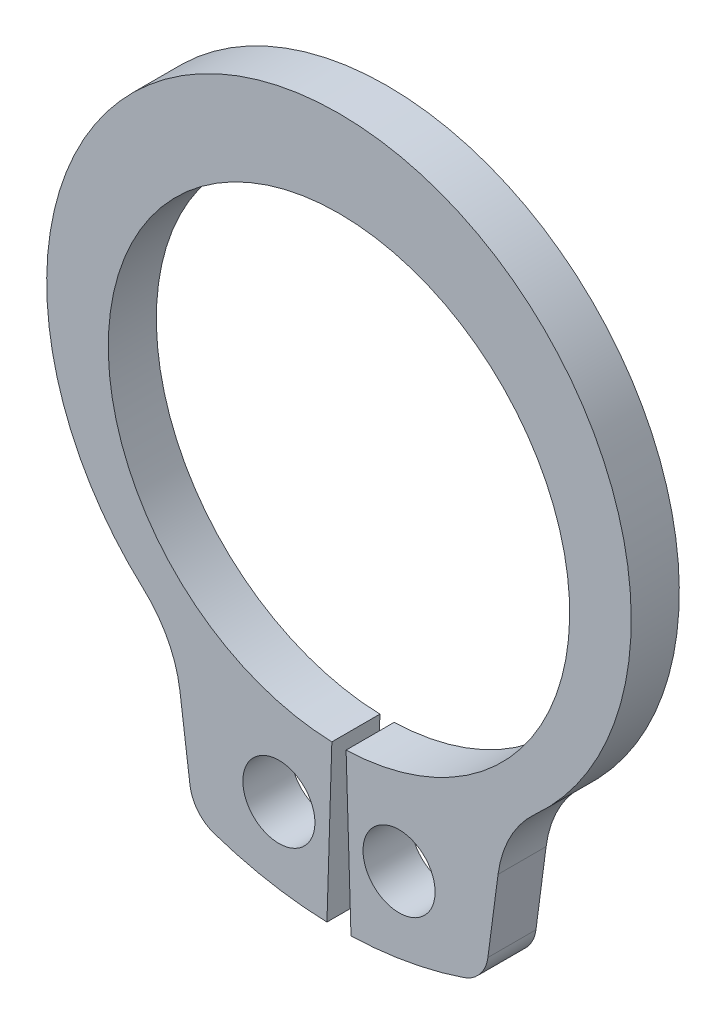
ISO-10303-21;
HEADER;
FILE_DESCRIPTION(('STEP AP214'),'2;1');
FILE_NAME('part.step','',(''),(''),'','','');
FILE_SCHEMA(('AUTOMOTIVE_DESIGN { 1 0 10303 214 1 1 1 1 }'));
ENDSEC;
DATA;
#1=APPLICATION_CONTEXT('core data for automotive mechanical design processes');
#2=APPLICATION_PROTOCOL_DEFINITION('international standard','automotive_design',2000,#1);
#3=PRODUCT_CONTEXT('',#1,'mechanical');
#4=PRODUCT('Part','Part','',(#3));
#5=PRODUCT_RELATED_PRODUCT_CATEGORY('part','',(#4));
#6=PRODUCT_DEFINITION_FORMATION('','',#4);
#7=PRODUCT_DEFINITION_CONTEXT('part definition',#1,'design');
#8=PRODUCT_DEFINITION('design','',#6,#7);
#9=PRODUCT_DEFINITION_SHAPE('','',#8);
#10=(LENGTH_UNIT() NAMED_UNIT(*) SI_UNIT(.MILLI.,.METRE.));
#11=(NAMED_UNIT(*) PLANE_ANGLE_UNIT() SI_UNIT($,.RADIAN.));
#12=(NAMED_UNIT(*) SI_UNIT($,.STERADIAN.) SOLID_ANGLE_UNIT());
#13=UNCERTAINTY_MEASURE_WITH_UNIT(LENGTH_MEASURE(1.E-05),#10,'distance_accuracy_value','');
#14=(GEOMETRIC_REPRESENTATION_CONTEXT(3) GLOBAL_UNCERTAINTY_ASSIGNED_CONTEXT((#13)) GLOBAL_UNIT_ASSIGNED_CONTEXT((#10,
#11,#12)) REPRESENTATION_CONTEXT('',''));
#15=CARTESIAN_POINT('',(0.,0.,0.));
#16=DIRECTION('',(0.,0.,1.));
#17=DIRECTION('',(1.,0.,0.));
#18=AXIS2_PLACEMENT_3D('',#15,#16,#17);
#19=CARTESIAN_POINT('',(0.,0.,-1.));
#20=DIRECTION('',(0.,0.,1.));
#21=DIRECTION('',(1.,0.,0.));
#22=AXIS2_PLACEMENT_3D('',#19,#20,#21);
#23=CYLINDRICAL_SURFACE('',#22,4.8);
#24=CARTESIAN_POINT('',(0.,0.,0.));
#25=DIRECTION('',(0.,0.,-1.));
#26=DIRECTION('',(1.,0.,0.));
#27=AXIS2_PLACEMENT_3D('',#24,#25,#26);
#28=CIRCLE('',#27,4.8);
#29=CARTESIAN_POINT('',(-0.148148148148148,-4.79771321841982,0.));
#30=VERTEX_POINT('',#29);
#31=CARTESIAN_POINT('',(0.148148148148148,-4.79771321841982,0.));
#32=VERTEX_POINT('',#31);
#33=EDGE_CURVE('E160',#30,#32,#28,.T.);
#34=ORIENTED_EDGE('',*,*,#33,.F.);
#35=DIRECTION('',(0.,0.,1.));
#36=VECTOR('',#35,1.);
#37=CARTESIAN_POINT('',(-0.148148148148148,-4.79771321841982,-1.));
#38=LINE('',#37,#36);
#39=CARTESIAN_POINT('',(-0.148148148148148,-4.79771321841982,-1.));
#40=VERTEX_POINT('',#39);
#41=EDGE_CURVE('E11',#40,#30,#38,.T.);
#42=ORIENTED_EDGE('',*,*,#41,.F.);
#43=CARTESIAN_POINT('',(0.,0.,-1.));
#44=DIRECTION('',(0.,0.,-1.));
#45=DIRECTION('',(1.,0.,0.));
#46=AXIS2_PLACEMENT_3D('',#43,#44,#45);
#47=CIRCLE('',#46,4.8);
#48=CARTESIAN_POINT('',(0.148148148148148,-4.79771321841982,-1.));
#49=VERTEX_POINT('',#48);
#50=EDGE_CURVE('E193',#40,#49,#47,.T.);
#51=ORIENTED_EDGE('',*,*,#50,.T.);
#52=DIRECTION('',(0.,0.,1.));
#53=VECTOR('',#52,1.);
#54=CARTESIAN_POINT('',(0.148148148148148,-4.79771321841982,-1.));
#55=LINE('',#54,#53);
#56=EDGE_CURVE('E42',#49,#32,#55,.T.);
#57=ORIENTED_EDGE('',*,*,#56,.T.);
#58=EDGE_LOOP('',(#34,#42,#51,#57));
#59=FACE_BOUND('',#58,.T.);
#60=ADVANCED_FACE('F39',(#59),#23,.F.);
#61=CARTESIAN_POINT('',(-0.148148148148148,-4.79771321841982,-1.));
#62=DIRECTION('',(0.999523587170796,-0.0308641975308642,0.));
#63=DIRECTION('',(0.0308641975308642,0.999523587170796,0.));
#64=AXIS2_PLACEMENT_3D('',#61,#62,#63);
#65=PLANE('',#64);
#66=DIRECTION('',(0.0308641975308642,0.999523587170796,0.));
#67=VECTOR('',#66,1.);
#68=CARTESIAN_POINT('',(-0.148148148148148,-4.79771321841982,0.));
#69=LINE('',#68,#67);
#70=CARTESIAN_POINT('',(-0.25,-8.09614105608345,0.));
#71=VERTEX_POINT('',#70);
#72=EDGE_CURVE('E191',#71,#30,#69,.T.);
#73=ORIENTED_EDGE('',*,*,#72,.F.);
#74=DIRECTION('',(0.,0.,1.));
#75=VECTOR('',#74,1.);
#76=CARTESIAN_POINT('',(-0.25,-8.09614105608345,-1.));
#77=LINE('',#76,#75);
#78=CARTESIAN_POINT('',(-0.25,-8.09614105608345,-1.));
#79=VERTEX_POINT('',#78);
#80=EDGE_CURVE('E48',#79,#71,#77,.T.);
#81=ORIENTED_EDGE('',*,*,#80,.F.);
#82=DIRECTION('',(0.0308641975308642,0.999523587170796,0.));
#83=VECTOR('',#82,1.);
#84=CARTESIAN_POINT('',(-0.148148148148148,-4.79771321841982,-1.));
#85=LINE('',#84,#83);
#86=EDGE_CURVE('E150',#79,#40,#85,.T.);
#87=ORIENTED_EDGE('',*,*,#86,.T.);
#88=ORIENTED_EDGE('',*,*,#41,.T.);
#89=EDGE_LOOP('',(#73,#81,#87,#88));
#90=FACE_BOUND('',#89,.T.);
#91=ADVANCED_FACE('F213',(#90),#65,.T.);
#92=CARTESIAN_POINT('',(0.,0.,-1.));
#93=DIRECTION('',(0.,0.,1.));
#94=DIRECTION('',(1.,0.,0.));
#95=AXIS2_PLACEMENT_3D('',#92,#93,#94);
#96=CYLINDRICAL_SURFACE('',#95,8.1);
#97=CARTESIAN_POINT('',(0.,0.,0.));
#98=DIRECTION('',(0.,0.,1.));
#99=DIRECTION('',(1.,0.,0.));
#100=AXIS2_PLACEMENT_3D('',#97,#98,#99);
#101=CIRCLE('',#100,8.1);
#102=CARTESIAN_POINT('',(-2.59511535496144,-7.67302914724317,0.));
#103=VERTEX_POINT('',#102);
#104=EDGE_CURVE('E137',#103,#71,#101,.T.);
#105=ORIENTED_EDGE('',*,*,#104,.F.);
#106=DIRECTION('',(0.,0.,1.));
#107=VECTOR('',#106,1.);
#108=CARTESIAN_POINT('',(-2.59511535496144,-7.67302914724317,-1.));
#109=LINE('',#108,#107);
#110=CARTESIAN_POINT('',(-2.59511535496144,-7.67302914724317,-1.));
#111=VERTEX_POINT('',#110);
#112=EDGE_CURVE('E132',#111,#103,#109,.T.);
#113=ORIENTED_EDGE('',*,*,#112,.F.);
#114=CARTESIAN_POINT('',(0.,0.,-1.));
#115=DIRECTION('',(0.,0.,1.));
#116=DIRECTION('',(1.,0.,0.));
#117=AXIS2_PLACEMENT_3D('',#114,#115,#116);
#118=CIRCLE('',#117,8.1);
#119=EDGE_CURVE('E135',#111,#79,#118,.T.);
#120=ORIENTED_EDGE('',*,*,#119,.T.);
#121=ORIENTED_EDGE('',*,*,#80,.T.);
#122=EDGE_LOOP('',(#105,#113,#120,#121));
#123=FACE_BOUND('',#122,.T.);
#124=ADVANCED_FACE('F134',(#123),#96,.T.);
#125=CARTESIAN_POINT('',(-2.35482689616871,-6.9625634854614,-1.));
#126=DIRECTION('',(0.,0.,1.));
#127=DIRECTION('',(1.,0.,0.));
#128=AXIS2_PLACEMENT_3D('',#125,#126,#127);
#129=CYLINDRICAL_SURFACE('',#128,0.75);
#130=CARTESIAN_POINT('',(-2.35482689616871,-6.9625634854614,0.));
#131=DIRECTION('',(0.,0.,1.));
#132=DIRECTION('',(1.,0.,0.));
#133=AXIS2_PLACEMENT_3D('',#130,#131,#132);
#134=CIRCLE('',#133,0.75);
#135=CARTESIAN_POINT('',(-3.09841054219907,-7.06045812962644,0.));
#136=VERTEX_POINT('',#135);
#137=EDGE_CURVE('E188',#136,#103,#134,.T.);
#138=ORIENTED_EDGE('',*,*,#137,.F.);
#139=DIRECTION('',(0.,0.,1.));
#140=VECTOR('',#139,1.);
#141=CARTESIAN_POINT('',(-3.09841054219907,-7.06045812962644,-1.));
#142=LINE('',#141,#140);
#143=CARTESIAN_POINT('',(-3.09841054219907,-7.06045812962644,-1.));
#144=VERTEX_POINT('',#143);
#145=EDGE_CURVE('E142',#144,#136,#142,.T.);
#146=ORIENTED_EDGE('',*,*,#145,.F.);
#147=CARTESIAN_POINT('',(-2.35482689616871,-6.9625634854614,-1.));
#148=DIRECTION('',(0.,0.,1.));
#149=DIRECTION('',(1.,0.,0.));
#150=AXIS2_PLACEMENT_3D('',#147,#148,#149);
#151=CIRCLE('',#150,0.75);
#152=EDGE_CURVE('E148',#144,#111,#151,.T.);
#153=ORIENTED_EDGE('',*,*,#152,.T.);
#154=ORIENTED_EDGE('',*,*,#112,.T.);
#155=EDGE_LOOP('',(#138,#146,#153,#154));
#156=FACE_BOUND('',#155,.T.);
#157=ADVANCED_FACE('F152',(#156),#129,.T.);
#158=CARTESIAN_POINT('',(-3.30965181475856,-5.45592136480539,-1.));
#159=DIRECTION('',(-0.99144486137381,-0.130526192220052,0.));
#160=DIRECTION('',(0.130526192220052,-0.99144486137381,0.));
#161=AXIS2_PLACEMENT_3D('',#158,#159,#160);
#162=PLANE('',#161);
#163=DIRECTION('',(0.130526192220052,-0.99144486137381,0.));
#164=VECTOR('',#163,1.);
#165=CARTESIAN_POINT('',(-3.30965181475856,-5.45592136480539,0.));
#166=LINE('',#165,#164);
#167=CARTESIAN_POINT('',(-3.30965181475856,-5.45592136480539,0.));
#168=VERTEX_POINT('',#167);
#169=EDGE_CURVE('E185',#168,#136,#166,.T.);
#170=ORIENTED_EDGE('',*,*,#169,.F.);
#171=DIRECTION('',(0.,0.,1.));
#172=VECTOR('',#171,1.);
#173=CARTESIAN_POINT('',(-3.30965181475856,-5.45592136480539,-1.));
#174=LINE('',#173,#172);
#175=CARTESIAN_POINT('',(-3.30965181475856,-5.45592136480539,-1.));
#176=VERTEX_POINT('',#175);
#177=EDGE_CURVE('E197',#176,#168,#174,.T.);
#178=ORIENTED_EDGE('',*,*,#177,.F.);
#179=DIRECTION('',(0.130526192220052,-0.99144486137381,0.));
#180=VECTOR('',#179,1.);
#181=CARTESIAN_POINT('',(-3.30965181475856,-5.45592136480539,-1.));
#182=LINE('',#181,#180);
#183=EDGE_CURVE('E153',#176,#144,#182,.T.);
#184=ORIENTED_EDGE('',*,*,#183,.T.);
#185=ORIENTED_EDGE('',*,*,#145,.T.);
#186=EDGE_LOOP('',(#170,#178,#184,#185));
#187=FACE_BOUND('',#186,.T.);
#188=ADVANCED_FACE('F226',(#187),#162,.T.);
#189=CARTESIAN_POINT('',(-5.68605087745157,-5.76878023667328,-1.));
#190=DIRECTION('',(0.,0.,1.));
#191=DIRECTION('',(1.,0.,0.));
#192=AXIS2_PLACEMENT_3D('',#189,#190,#191);
#193=CYLINDRICAL_SURFACE('',#192,2.3969049165277);
#194=CARTESIAN_POINT('',(-5.68605087745157,-5.76878023667328,0.));
#195=DIRECTION('',(0.,0.,-1.));
#196=DIRECTION('',(1.,0.,0.));
#197=AXIS2_PLACEMENT_3D('',#194,#195,#196);
#198=CIRCLE('',#197,2.3969049165277);
#199=CARTESIAN_POINT('',(-4.07842108653022,-3.99095020142895,0.));
#200=VERTEX_POINT('',#199);
#201=EDGE_CURVE('E182',#200,#168,#198,.T.);
#202=ORIENTED_EDGE('',*,*,#201,.F.);
#203=DIRECTION('',(0.,0.,1.));
#204=VECTOR('',#203,1.);
#205=CARTESIAN_POINT('',(-4.07842108653022,-3.99095020142895,-1.));
#206=LINE('',#205,#204);
#207=CARTESIAN_POINT('',(-4.07842108653022,-3.99095020142895,-1.));
#208=VERTEX_POINT('',#207);
#209=EDGE_CURVE('E199',#208,#200,#206,.T.);
#210=ORIENTED_EDGE('',*,*,#209,.F.);
#211=CARTESIAN_POINT('',(-5.68605087745157,-5.76878023667328,-1.));
#212=DIRECTION('',(0.,0.,-1.));
#213=DIRECTION('',(1.,0.,0.));
#214=AXIS2_PLACEMENT_3D('',#211,#212,#213);
#215=CIRCLE('',#214,2.3969049165277);
#216=EDGE_CURVE('E155',#208,#176,#215,.T.);
#217=ORIENTED_EDGE('',*,*,#216,.T.);
#218=ORIENTED_EDGE('',*,*,#177,.T.);
#219=EDGE_LOOP('',(#202,#210,#217,#218));
#220=FACE_BOUND('',#219,.T.);
#221=ADVANCED_FACE('F229',(#220),#193,.F.);
#222=CARTESIAN_POINT('',(0.,0.519254539086392,-1.));
#223=DIRECTION('',(0.,0.,1.));
#224=DIRECTION('',(1.,0.,0.));
#225=AXIS2_PLACEMENT_3D('',#222,#223,#224);
#226=CYLINDRICAL_SURFACE('',#225,6.08074546091361);
#227=CARTESIAN_POINT('',(0.,0.519254539086392,0.));
#228=DIRECTION('',(0.,0.,1.));
#229=DIRECTION('',(1.,0.,0.));
#230=AXIS2_PLACEMENT_3D('',#227,#228,#229);
#231=CIRCLE('',#230,6.08074546091361);
#232=CARTESIAN_POINT('',(4.07842108653021,-3.99095020142896,0.));
#233=VERTEX_POINT('',#232);
#234=EDGE_CURVE('E179',#233,#200,#231,.T.);
#235=ORIENTED_EDGE('',*,*,#234,.F.);
#236=DIRECTION('',(0.,0.,1.));
#237=VECTOR('',#236,1.);
#238=CARTESIAN_POINT('',(4.07842108653021,-3.99095020142896,-1.));
#239=LINE('',#238,#237);
#240=CARTESIAN_POINT('',(4.07842108653021,-3.99095020142896,-1.));
#241=VERTEX_POINT('',#240);
#242=EDGE_CURVE('E201',#241,#233,#239,.T.);
#243=ORIENTED_EDGE('',*,*,#242,.F.);
#244=CARTESIAN_POINT('',(0.,0.519254539086392,-1.));
#245=DIRECTION('',(0.,0.,1.));
#246=DIRECTION('',(1.,0.,0.));
#247=AXIS2_PLACEMENT_3D('',#244,#245,#246);
#248=CIRCLE('',#247,6.08074546091361);
#249=EDGE_CURVE('E303',#241,#208,#248,.T.);
#250=ORIENTED_EDGE('',*,*,#249,.T.);
#251=ORIENTED_EDGE('',*,*,#209,.T.);
#252=EDGE_LOOP('',(#235,#243,#250,#251));
#253=FACE_BOUND('',#252,.T.);
#254=ADVANCED_FACE('F233',(#253),#226,.T.);
#255=CARTESIAN_POINT('',(5.68605087745157,-5.76878023667328,-1.));
#256=DIRECTION('',(0.,0.,1.));
#257=DIRECTION('',(1.,0.,0.));
#258=AXIS2_PLACEMENT_3D('',#255,#256,#257);
#259=CYLINDRICAL_SURFACE('',#258,2.3969049165277);
#260=CARTESIAN_POINT('',(5.68605087745157,-5.76878023667328,0.));
#261=DIRECTION('',(0.,0.,-1.));
#262=DIRECTION('',(1.,0.,0.));
#263=AXIS2_PLACEMENT_3D('',#260,#261,#262);
#264=CIRCLE('',#263,2.3969049165277);
#265=CARTESIAN_POINT('',(3.30965181475856,-5.45592136480539,0.));
#266=VERTEX_POINT('',#265);
#267=EDGE_CURVE('E176',#266,#233,#264,.T.);
#268=ORIENTED_EDGE('',*,*,#267,.F.);
#269=DIRECTION('',(0.,0.,1.));
#270=VECTOR('',#269,1.);
#271=CARTESIAN_POINT('',(3.30965181475856,-5.45592136480539,-1.));
#272=LINE('',#271,#270);
#273=CARTESIAN_POINT('',(3.30965181475856,-5.45592136480539,-1.));
#274=VERTEX_POINT('',#273);
#275=EDGE_CURVE('E203',#274,#266,#272,.T.);
#276=ORIENTED_EDGE('',*,*,#275,.F.);
#277=CARTESIAN_POINT('',(5.68605087745157,-5.76878023667328,-1.));
#278=DIRECTION('',(0.,0.,-1.));
#279=DIRECTION('',(1.,0.,0.));
#280=AXIS2_PLACEMENT_3D('',#277,#278,#279);
#281=CIRCLE('',#280,2.3969049165277);
#282=EDGE_CURVE('E300',#274,#241,#281,.T.);
#283=ORIENTED_EDGE('',*,*,#282,.T.);
#284=ORIENTED_EDGE('',*,*,#242,.T.);
#285=EDGE_LOOP('',(#268,#276,#283,#284));
#286=FACE_BOUND('',#285,.T.);
#287=ADVANCED_FACE('F237',(#286),#259,.F.);
#288=CARTESIAN_POINT('',(3.30965181475856,-5.45592136480539,-1.));
#289=DIRECTION('',(0.99144486137381,-0.130526192220052,0.));
#290=DIRECTION('',(0.130526192220052,0.99144486137381,0.));
#291=AXIS2_PLACEMENT_3D('',#288,#289,#290);
#292=PLANE('',#291);
#293=DIRECTION('',(0.130526192220052,0.99144486137381,0.));
#294=VECTOR('',#293,1.);
#295=CARTESIAN_POINT('',(3.30965181475856,-5.45592136480539,0.));
#296=LINE('',#295,#294);
#297=CARTESIAN_POINT('',(3.09841054219907,-7.06045812962644,0.));
#298=VERTEX_POINT('',#297);
#299=EDGE_CURVE('E173',#298,#266,#296,.T.);
#300=ORIENTED_EDGE('',*,*,#299,.F.);
#301=DIRECTION('',(0.,0.,1.));
#302=VECTOR('',#301,1.);
#303=CARTESIAN_POINT('',(3.09841054219907,-7.06045812962644,-1.));
#304=LINE('',#303,#302);
#305=CARTESIAN_POINT('',(3.09841054219907,-7.06045812962644,-1.));
#306=VERTEX_POINT('',#305);
#307=EDGE_CURVE('E205',#306,#298,#304,.T.);
#308=ORIENTED_EDGE('',*,*,#307,.F.);
#309=DIRECTION('',(0.130526192220052,0.99144486137381,0.));
#310=VECTOR('',#309,1.);
#311=CARTESIAN_POINT('',(3.30965181475856,-5.45592136480539,-1.));
#312=LINE('',#311,#310);
#313=EDGE_CURVE('E297',#306,#274,#312,.T.);
#314=ORIENTED_EDGE('',*,*,#313,.T.);
#315=ORIENTED_EDGE('',*,*,#275,.T.);
#316=EDGE_LOOP('',(#300,#308,#314,#315));
#317=FACE_BOUND('',#316,.T.);
#318=ADVANCED_FACE('F241',(#317),#292,.T.);
#319=CARTESIAN_POINT('',(2.35482689616871,-6.9625634854614,-1.));
#320=DIRECTION('',(0.,0.,1.));
#321=DIRECTION('',(1.,0.,0.));
#322=AXIS2_PLACEMENT_3D('',#319,#320,#321);
#323=CYLINDRICAL_SURFACE('',#322,0.75);
#324=CARTESIAN_POINT('',(2.35482689616871,-6.9625634854614,0.));
#325=DIRECTION('',(0.,0.,1.));
#326=DIRECTION('',(-1.,0.,0.));
#327=AXIS2_PLACEMENT_3D('',#324,#325,#326);
#328=CIRCLE('',#327,0.75);
#329=CARTESIAN_POINT('',(2.59511535496144,-7.67302914724318,0.));
#330=VERTEX_POINT('',#329);
#331=EDGE_CURVE('E170',#330,#298,#328,.T.);
#332=ORIENTED_EDGE('',*,*,#331,.F.);
#333=DIRECTION('',(0.,0.,1.));
#334=VECTOR('',#333,1.);
#335=CARTESIAN_POINT('',(2.59511535496144,-7.67302914724318,-1.));
#336=LINE('',#335,#334);
#337=CARTESIAN_POINT('',(2.59511535496144,-7.67302914724318,-1.));
#338=VERTEX_POINT('',#337);
#339=EDGE_CURVE('E207',#338,#330,#336,.T.);
#340=ORIENTED_EDGE('',*,*,#339,.F.);
#341=CARTESIAN_POINT('',(2.35482689616871,-6.9625634854614,-1.));
#342=DIRECTION('',(0.,0.,1.));
#343=DIRECTION('',(-1.,0.,0.));
#344=AXIS2_PLACEMENT_3D('',#341,#342,#343);
#345=CIRCLE('',#344,0.75);
#346=EDGE_CURVE('E294',#338,#306,#345,.T.);
#347=ORIENTED_EDGE('',*,*,#346,.T.);
#348=ORIENTED_EDGE('',*,*,#307,.T.);
#349=EDGE_LOOP('',(#332,#340,#347,#348));
#350=FACE_BOUND('',#349,.T.);
#351=ADVANCED_FACE('F245',(#350),#323,.T.);
#352=CARTESIAN_POINT('',(0.,0.,-1.));
#353=DIRECTION('',(0.,0.,1.));
#354=DIRECTION('',(1.,0.,0.));
#355=AXIS2_PLACEMENT_3D('',#352,#353,#354);
#356=CYLINDRICAL_SURFACE('',#355,8.1);
#357=CARTESIAN_POINT('',(0.,0.,0.));
#358=DIRECTION('',(0.,0.,1.));
#359=DIRECTION('',(1.,0.,0.));
#360=AXIS2_PLACEMENT_3D('',#357,#358,#359);
#361=CIRCLE('',#360,8.1);
#362=CARTESIAN_POINT('',(0.249999999999997,-8.09614105608345,0.));
#363=VERTEX_POINT('',#362);
#364=EDGE_CURVE('E167',#363,#330,#361,.T.);
#365=ORIENTED_EDGE('',*,*,#364,.F.);
#366=DIRECTION('',(0.,0.,1.));
#367=VECTOR('',#366,1.);
#368=CARTESIAN_POINT('',(0.249999999999997,-8.09614105608345,-1.));
#369=LINE('',#368,#367);
#370=CARTESIAN_POINT('',(0.249999999999997,-8.09614105608345,-1.));
#371=VERTEX_POINT('',#370);
#372=EDGE_CURVE('E208',#371,#363,#369,.T.);
#373=ORIENTED_EDGE('',*,*,#372,.F.);
#374=CARTESIAN_POINT('',(0.,0.,-1.));
#375=DIRECTION('',(0.,0.,1.));
#376=DIRECTION('',(1.,0.,0.));
#377=AXIS2_PLACEMENT_3D('',#374,#375,#376);
#378=CIRCLE('',#377,8.1);
#379=EDGE_CURVE('E291',#371,#338,#378,.T.);
#380=ORIENTED_EDGE('',*,*,#379,.T.);
#381=ORIENTED_EDGE('',*,*,#339,.T.);
#382=EDGE_LOOP('',(#365,#373,#380,#381));
#383=FACE_BOUND('',#382,.T.);
#384=ADVANCED_FACE('F249',(#383),#356,.T.);
#385=CARTESIAN_POINT('',(0.148148148148148,-4.79771321841982,-1.));
#386=DIRECTION('',(-0.999523587170796,-0.0308641975308642,0.));
#387=DIRECTION('',(0.0308641975308642,-0.999523587170796,0.));
#388=AXIS2_PLACEMENT_3D('',#385,#386,#387);
#389=PLANE('',#388);
#390=DIRECTION('',(0.0308641975308642,-0.999523587170796,0.));
#391=VECTOR('',#390,1.);
#392=CARTESIAN_POINT('',(0.148148148148148,-4.79771321841982,0.));
#393=LINE('',#392,#391);
#394=EDGE_CURVE('E163',#32,#363,#393,.T.);
#395=ORIENTED_EDGE('',*,*,#394,.F.);
#396=ORIENTED_EDGE('',*,*,#56,.F.);
#397=DIRECTION('',(0.0308641975308642,-0.999523587170796,0.));
#398=VECTOR('',#397,1.);
#399=CARTESIAN_POINT('',(0.148148148148148,-4.79771321841982,-1.));
#400=LINE('',#399,#398);
#401=EDGE_CURVE('E289',#49,#371,#400,.T.);
#402=ORIENTED_EDGE('',*,*,#401,.T.);
#403=ORIENTED_EDGE('',*,*,#372,.T.);
#404=EDGE_LOOP('',(#395,#396,#402,#403));
#405=FACE_BOUND('',#404,.T.);
#406=ADVANCED_FACE('F210',(#405),#389,.T.);
#407=CARTESIAN_POINT('',(0.,0.,-1.));
#408=DIRECTION('',(0.,0.,1.));
#409=DIRECTION('',(1.,0.,0.));
#410=AXIS2_PLACEMENT_3D('',#407,#408,#409);
#411=PLANE('',#410);
#412=CARTESIAN_POINT('',(-1.25,-6.4296189622714,-1.));
#413=DIRECTION('',(0.,0.,1.));
#414=DIRECTION('',(1.,0.,0.));
#415=AXIS2_PLACEMENT_3D('',#412,#413,#414);
#416=CIRCLE('',#415,0.75);
#417=CARTESIAN_POINT('',(-0.5,-6.4296189622714,-1.));
#418=VERTEX_POINT('',#417);
#419=EDGE_CURVE('E276',#418,#418,#416,.T.);
#420=ORIENTED_EDGE('',*,*,#419,.T.);
#421=EDGE_LOOP('',(#420));
#422=FACE_BOUND('',#421,.T.);
#423=CARTESIAN_POINT('',(1.25,-6.4296189622714,-1.));
#424=DIRECTION('',(0.,0.,1.));
#425=DIRECTION('',(1.,0.,0.));
#426=AXIS2_PLACEMENT_3D('',#423,#424,#425);
#427=CIRCLE('',#426,0.75);
#428=CARTESIAN_POINT('',(2.,-6.4296189622714,-1.));
#429=VERTEX_POINT('',#428);
#430=EDGE_CURVE('E164',#429,#429,#427,.T.);
#431=ORIENTED_EDGE('',*,*,#430,.T.);
#432=EDGE_LOOP('',(#431));
#433=FACE_BOUND('',#432,.T.);
#434=ORIENTED_EDGE('',*,*,#50,.F.);
#435=ORIENTED_EDGE('',*,*,#86,.F.);
#436=ORIENTED_EDGE('',*,*,#119,.F.);
#437=ORIENTED_EDGE('',*,*,#152,.F.);
#438=ORIENTED_EDGE('',*,*,#183,.F.);
#439=ORIENTED_EDGE('',*,*,#216,.F.);
#440=ORIENTED_EDGE('',*,*,#249,.F.);
#441=ORIENTED_EDGE('',*,*,#282,.F.);
#442=ORIENTED_EDGE('',*,*,#313,.F.);
#443=ORIENTED_EDGE('',*,*,#346,.F.);
#444=ORIENTED_EDGE('',*,*,#379,.F.);
#445=ORIENTED_EDGE('',*,*,#401,.F.);
#446=EDGE_LOOP('',(#434,#435,#436,#437,#438,#439,#440,#441,#442,#443,#444,#445));
#447=FACE_BOUND('',#446,.T.);
#448=ADVANCED_FACE('F146',(#422,#433,#447),#411,.F.);
#449=CARTESIAN_POINT('',(0.,0.,0.));
#450=DIRECTION('',(0.,0.,1.));
#451=DIRECTION('',(1.,0.,0.));
#452=AXIS2_PLACEMENT_3D('',#449,#450,#451);
#453=PLANE('',#452);
#454=CARTESIAN_POINT('',(-1.25,-6.4296189622714,0.));
#455=DIRECTION('',(0.,0.,1.));
#456=DIRECTION('',(1.,0.,0.));
#457=AXIS2_PLACEMENT_3D('',#454,#455,#456);
#458=CIRCLE('',#457,0.75);
#459=CARTESIAN_POINT('',(-0.5,-6.4296189622714,0.));
#460=VERTEX_POINT('',#459);
#461=EDGE_CURVE('E279',#460,#460,#458,.T.);
#462=ORIENTED_EDGE('',*,*,#461,.F.);
#463=EDGE_LOOP('',(#462));
#464=FACE_BOUND('',#463,.T.);
#465=CARTESIAN_POINT('',(1.25,-6.4296189622714,0.));
#466=DIRECTION('',(0.,0.,1.));
#467=DIRECTION('',(1.,0.,0.));
#468=AXIS2_PLACEMENT_3D('',#465,#466,#467);
#469=CIRCLE('',#468,0.75);
#470=CARTESIAN_POINT('',(2.,-6.4296189622714,0.));
#471=VERTEX_POINT('',#470);
#472=EDGE_CURVE('E281',#471,#471,#469,.T.);
#473=ORIENTED_EDGE('',*,*,#472,.F.);
#474=EDGE_LOOP('',(#473));
#475=FACE_BOUND('',#474,.T.);
#476=ORIENTED_EDGE('',*,*,#33,.T.);
#477=ORIENTED_EDGE('',*,*,#394,.T.);
#478=ORIENTED_EDGE('',*,*,#364,.T.);
#479=ORIENTED_EDGE('',*,*,#331,.T.);
#480=ORIENTED_EDGE('',*,*,#299,.T.);
#481=ORIENTED_EDGE('',*,*,#267,.T.);
#482=ORIENTED_EDGE('',*,*,#234,.T.);
#483=ORIENTED_EDGE('',*,*,#201,.T.);
#484=ORIENTED_EDGE('',*,*,#169,.T.);
#485=ORIENTED_EDGE('',*,*,#137,.T.);
#486=ORIENTED_EDGE('',*,*,#104,.T.);
#487=ORIENTED_EDGE('',*,*,#72,.T.);
#488=EDGE_LOOP('',(#476,#477,#478,#479,#480,#481,#482,#483,#484,#485,#486,#487));
#489=FACE_BOUND('',#488,.T.);
#490=ADVANCED_FACE('F212',(#464,#475,#489),#453,.T.);
#491=CARTESIAN_POINT('',(1.25,-6.4296189622714,-1.));
#492=DIRECTION('',(0.,0.,1.));
#493=DIRECTION('',(1.,0.,0.));
#494=AXIS2_PLACEMENT_3D('',#491,#492,#493);
#495=CYLINDRICAL_SURFACE('',#494,0.75);
#496=ORIENTED_EDGE('',*,*,#430,.F.);
#497=EDGE_LOOP('',(#496));
#498=FACE_BOUND('',#497,.T.);
#499=ORIENTED_EDGE('',*,*,#472,.T.);
#500=EDGE_LOOP('',(#499));
#501=FACE_BOUND('',#500,.T.);
#502=ADVANCED_FACE('F261',(#498,#501),#495,.F.);
#503=CARTESIAN_POINT('',(-1.25,-6.4296189622714,-1.));
#504=DIRECTION('',(0.,0.,1.));
#505=DIRECTION('',(1.,0.,0.));
#506=AXIS2_PLACEMENT_3D('',#503,#504,#505);
#507=CYLINDRICAL_SURFACE('',#506,0.75);
#508=ORIENTED_EDGE('',*,*,#419,.F.);
#509=EDGE_LOOP('',(#508));
#510=FACE_BOUND('',#509,.T.);
#511=ORIENTED_EDGE('',*,*,#461,.T.);
#512=EDGE_LOOP('',(#511));
#513=FACE_BOUND('',#512,.T.);
#514=ADVANCED_FACE('F268',(#510,#513),#507,.F.);
#515=CLOSED_SHELL('',(#60,#91,#124,#157,#188,#221,#254,#287,#318,#351,#384,#406,#448,#490,#502,#514));
#516=MANIFOLD_SOLID_BREP('B2',#515);
#517=ADVANCED_BREP_SHAPE_REPRESENTATION('',(#18,#516),#14);
#518=SHAPE_DEFINITION_REPRESENTATION(#9,#517);
ENDSEC;
END-ISO-10303-21;
